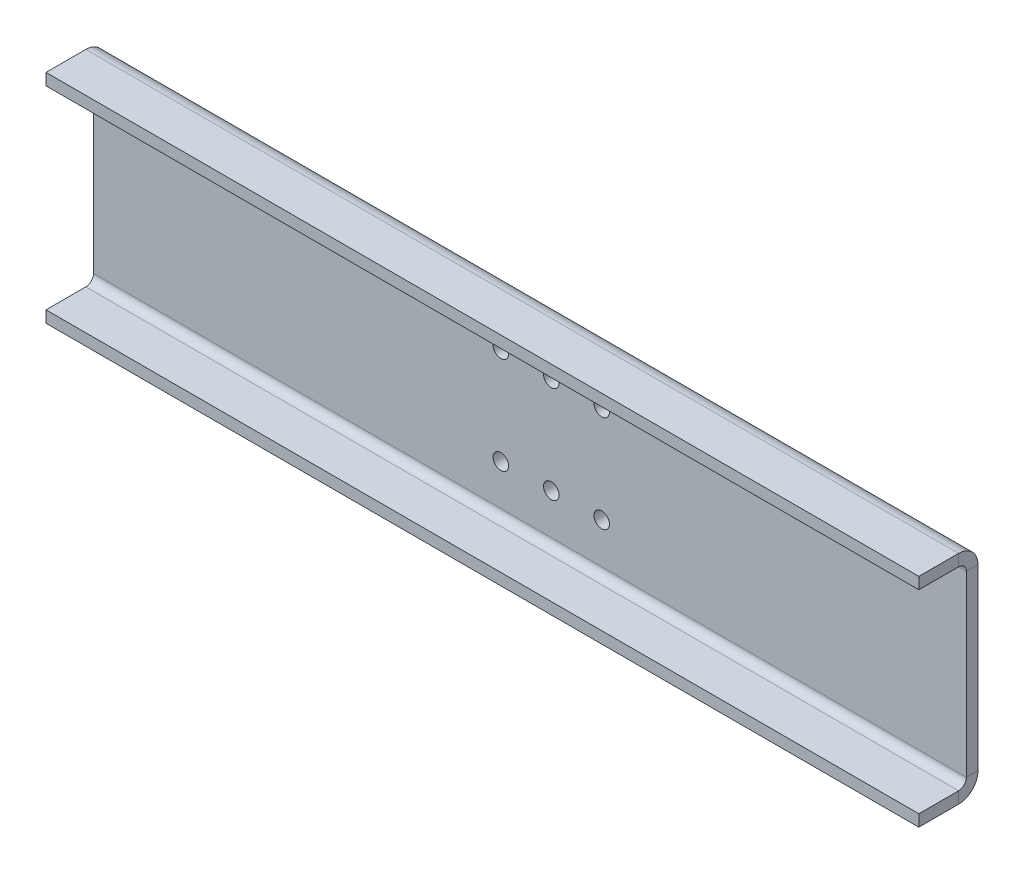
ISO-10303-21;
HEADER;
FILE_DESCRIPTION(('STEP AP214'),'2;1');
FILE_NAME('part.step','',(''),(''),'','','');
FILE_SCHEMA(('AUTOMOTIVE_DESIGN { 1 0 10303 214 1 1 1 1 }'));
ENDSEC;
DATA;
#1=APPLICATION_CONTEXT('core data for automotive mechanical design processes');
#2=APPLICATION_PROTOCOL_DEFINITION('international standard','automotive_design',2000,#1);
#3=PRODUCT_CONTEXT('',#1,'mechanical');
#4=PRODUCT('Part','Part','',(#3));
#5=PRODUCT_RELATED_PRODUCT_CATEGORY('part','',(#4));
#6=PRODUCT_DEFINITION_FORMATION('','',#4);
#7=PRODUCT_DEFINITION_CONTEXT('part definition',#1,'design');
#8=PRODUCT_DEFINITION('design','',#6,#7);
#9=PRODUCT_DEFINITION_SHAPE('','',#8);
#10=(LENGTH_UNIT() NAMED_UNIT(*) SI_UNIT(.MILLI.,.METRE.));
#11=(NAMED_UNIT(*) PLANE_ANGLE_UNIT() SI_UNIT($,.RADIAN.));
#12=(NAMED_UNIT(*) SI_UNIT($,.STERADIAN.) SOLID_ANGLE_UNIT());
#13=UNCERTAINTY_MEASURE_WITH_UNIT(LENGTH_MEASURE(1.E-05),#10,'distance_accuracy_value','');
#14=(GEOMETRIC_REPRESENTATION_CONTEXT(3) GLOBAL_UNCERTAINTY_ASSIGNED_CONTEXT((#13)) GLOBAL_UNIT_ASSIGNED_CONTEXT((#10,
#11,#12)) REPRESENTATION_CONTEXT('',''));
#15=CARTESIAN_POINT('',(0.,0.,0.));
#16=DIRECTION('',(0.,0.,1.));
#17=DIRECTION('',(1.,0.,0.));
#18=AXIS2_PLACEMENT_3D('',#15,#16,#17);
#19=CARTESIAN_POINT('',(0.,39.1323199636982,34.6301071074805));
#20=DIRECTION('',(0.,0.,1.));
#21=DIRECTION('',(0.,-1.,0.));
#22=AXIS2_PLACEMENT_3D('',#19,#20,#21);
#23=PLANE('',#22);
#24=CARTESIAN_POINT('',(64.5,40.5011064281089,34.6301071074805));
#25=DIRECTION('',(0.,0.,1.));
#26=DIRECTION('',(0.,-1.,0.));
#27=AXIS2_PLACEMENT_3D('',#24,#25,#26);
#28=CIRCLE('',#27,2.);
#29=CARTESIAN_POINT('',(64.5,38.501106428109,34.6301071074805));
#30=VERTEX_POINT('',#29);
#31=EDGE_CURVE('E227',#30,#30,#28,.T.);
#32=ORIENTED_EDGE('',*,*,#31,.T.);
#33=EDGE_LOOP('',(#32));
#34=FACE_BOUND('',#33,.T.);
#35=CARTESIAN_POINT('',(51.5,40.5011064281089,34.6301071074805));
#36=DIRECTION('',(0.,0.,1.));
#37=DIRECTION('',(0.,-1.,0.));
#38=AXIS2_PLACEMENT_3D('',#35,#36,#37);
#39=CIRCLE('',#38,2.);
#40=CARTESIAN_POINT('',(51.5,38.501106428109,34.6301071074805));
#41=VERTEX_POINT('',#40);
#42=EDGE_CURVE('E254',#41,#41,#39,.T.);
#43=ORIENTED_EDGE('',*,*,#42,.T.);
#44=EDGE_LOOP('',(#43));
#45=FACE_BOUND('',#44,.T.);
#46=CARTESIAN_POINT('',(38.5,40.5011064281089,34.6301071074805));
#47=DIRECTION('',(0.,0.,1.));
#48=DIRECTION('',(0.,-1.,0.));
#49=AXIS2_PLACEMENT_3D('',#46,#47,#48);
#50=CIRCLE('',#49,2.);
#51=CARTESIAN_POINT('',(38.5,38.501106428109,34.6301071074805));
#52=VERTEX_POINT('',#51);
#53=EDGE_CURVE('E257',#52,#52,#50,.T.);
#54=ORIENTED_EDGE('',*,*,#53,.T.);
#55=EDGE_LOOP('',(#54));
#56=FACE_BOUND('',#55,.T.);
#57=CARTESIAN_POINT('',(38.5,15.5011064281089,34.6301071074804));
#58=DIRECTION('',(0.,0.,1.));
#59=DIRECTION('',(0.,-1.,0.));
#60=AXIS2_PLACEMENT_3D('',#57,#58,#59);
#61=CIRCLE('',#60,2.);
#62=CARTESIAN_POINT('',(38.5,13.5011064281089,34.6301071074804));
#63=VERTEX_POINT('',#62);
#64=EDGE_CURVE('E260',#63,#63,#61,.T.);
#65=ORIENTED_EDGE('',*,*,#64,.T.);
#66=EDGE_LOOP('',(#65));
#67=FACE_BOUND('',#66,.T.);
#68=CARTESIAN_POINT('',(51.5,15.5011064281089,34.6301071074804));
#69=DIRECTION('',(0.,0.,1.));
#70=DIRECTION('',(0.,-1.,0.));
#71=AXIS2_PLACEMENT_3D('',#68,#69,#70);
#72=CIRCLE('',#71,2.);
#73=CARTESIAN_POINT('',(51.5,13.5011064281089,34.6301071074804));
#74=VERTEX_POINT('',#73);
#75=EDGE_CURVE('E263',#74,#74,#72,.T.);
#76=ORIENTED_EDGE('',*,*,#75,.T.);
#77=EDGE_LOOP('',(#76));
#78=FACE_BOUND('',#77,.T.);
#79=CARTESIAN_POINT('',(64.5,15.5011064281089,34.6301071074804));
#80=DIRECTION('',(0.,0.,1.));
#81=DIRECTION('',(0.,-1.,0.));
#82=AXIS2_PLACEMENT_3D('',#79,#80,#81);
#83=CIRCLE('',#82,2.);
#84=CARTESIAN_POINT('',(64.5,13.5011064281089,34.6301071074804));
#85=VERTEX_POINT('',#84);
#86=EDGE_CURVE('E235',#85,#85,#83,.T.);
#87=ORIENTED_EDGE('',*,*,#86,.T.);
#88=EDGE_LOOP('',(#87));
#89=FACE_BOUND('',#88,.T.);
#90=DIRECTION('',(0.,-1.,0.));
#91=VECTOR('',#90,1.);
#92=CARTESIAN_POINT('',(158.5,39.1323199636982,34.6301071074805));
#93=LINE('',#92,#91);
#94=CARTESIAN_POINT('',(158.5,5.00000000000002,34.6301071074803));
#95=VERTEX_POINT('',#94);
#96=CARTESIAN_POINT('',(158.5,51.002212856218,34.6301071074805));
#97=VERTEX_POINT('',#96);
#98=EDGE_CURVE('E62',#95,#97,#93,.F.);
#99=ORIENTED_EDGE('',*,*,#98,.F.);
#100=DIRECTION('',(-1.,0.,0.));
#101=VECTOR('',#100,1.);
#102=CARTESIAN_POINT('',(0.,5.00000000000002,34.6301071074803));
#103=LINE('',#102,#101);
#104=CARTESIAN_POINT('',(-66.5,5.00000000000002,34.6301071074803));
#105=VERTEX_POINT('',#104);
#106=EDGE_CURVE('E54',#95,#105,#103,.T.);
#107=ORIENTED_EDGE('',*,*,#106,.T.);
#108=DIRECTION('',(0.,-1.,0.));
#109=VECTOR('',#108,1.);
#110=CARTESIAN_POINT('',(-66.5,39.1323199636982,34.6301071074805));
#111=LINE('',#110,#109);
#112=CARTESIAN_POINT('',(-66.5,51.002212856218,34.6301071074805));
#113=VERTEX_POINT('',#112);
#114=EDGE_CURVE('E70',#113,#105,#111,.T.);
#115=ORIENTED_EDGE('',*,*,#114,.F.);
#116=DIRECTION('',(-1.,0.,0.));
#117=VECTOR('',#116,1.);
#118=CARTESIAN_POINT('',(0.,51.002212856218,34.6301071074805));
#119=LINE('',#118,#117);
#120=EDGE_CURVE('E273',#97,#113,#119,.T.);
#121=ORIENTED_EDGE('',*,*,#120,.F.);
#122=EDGE_LOOP('',(#99,#107,#115,#121));
#123=FACE_BOUND('',#122,.T.);
#124=ADVANCED_FACE('F45',(#34,#45,#56,#67,#78,#89,#123),#23,.F.);
#125=CARTESIAN_POINT('',(158.5,66.751106428109,37.6301071074805));
#126=DIRECTION('',(1.,0.,0.));
#127=DIRECTION('',(0.,1.,0.));
#128=AXIS2_PLACEMENT_3D('',#125,#126,#127);
#129=PLANE('',#128);
#130=DIRECTION('',(0.,0.,1.));
#131=VECTOR('',#130,1.);
#132=CARTESIAN_POINT('',(158.5,5.,37.6301071074803));
#133=LINE('',#132,#131);
#134=CARTESIAN_POINT('',(158.5,5.,37.6301071074803));
#135=VERTEX_POINT('',#134);
#136=EDGE_CURVE('E12',#95,#135,#133,.T.);
#137=ORIENTED_EDGE('',*,*,#136,.F.);
#138=ORIENTED_EDGE('',*,*,#98,.T.);
#139=DIRECTION('',(0.,0.,1.));
#140=VECTOR('',#139,1.);
#141=CARTESIAN_POINT('',(158.5,51.002212856218,37.6301071074805));
#142=LINE('',#141,#140);
#143=CARTESIAN_POINT('',(158.5,51.002212856218,37.6301071074805));
#144=VERTEX_POINT('',#143);
#145=EDGE_CURVE('E270',#97,#144,#142,.T.);
#146=ORIENTED_EDGE('',*,*,#145,.T.);
#147=DIRECTION('',(0.,1.,0.));
#148=VECTOR('',#147,1.);
#149=CARTESIAN_POINT('',(158.5,66.751106428109,37.6301071074805));
#150=LINE('',#149,#148);
#151=EDGE_CURVE('E49',#135,#144,#150,.T.);
#152=ORIENTED_EDGE('',*,*,#151,.F.);
#153=EDGE_LOOP('',(#137,#138,#146,#152));
#154=FACE_BOUND('',#153,.T.);
#155=ADVANCED_FACE('F47',(#154),#129,.T.);
#156=CARTESIAN_POINT('',(-66.5,66.7511064281089,37.6301071074805));
#157=DIRECTION('',(-1.,0.,0.));
#158=DIRECTION('',(0.,-1.,0.));
#159=AXIS2_PLACEMENT_3D('',#156,#157,#158);
#160=PLANE('',#159);
#161=DIRECTION('',(0.,0.,-1.));
#162=VECTOR('',#161,1.);
#163=CARTESIAN_POINT('',(-66.5,5.,37.6301071074803));
#164=LINE('',#163,#162);
#165=CARTESIAN_POINT('',(-66.5,5.00000000000001,37.6301071074803));
#166=VERTEX_POINT('',#165);
#167=EDGE_CURVE('E279',#166,#105,#164,.T.);
#168=ORIENTED_EDGE('',*,*,#167,.F.);
#169=DIRECTION('',(0.,-1.,0.));
#170=VECTOR('',#169,1.);
#171=CARTESIAN_POINT('',(-66.5,66.7511064281089,37.6301071074805));
#172=LINE('',#171,#170);
#173=CARTESIAN_POINT('',(-66.5,51.002212856218,37.6301071074805));
#174=VERTEX_POINT('',#173);
#175=EDGE_CURVE('E241',#174,#166,#172,.T.);
#176=ORIENTED_EDGE('',*,*,#175,.F.);
#177=DIRECTION('',(0.,0.,-1.));
#178=VECTOR('',#177,1.);
#179=CARTESIAN_POINT('',(-66.5,51.002212856218,37.6301071074805));
#180=LINE('',#179,#178);
#181=EDGE_CURVE('E276',#174,#113,#180,.T.);
#182=ORIENTED_EDGE('',*,*,#181,.T.);
#183=ORIENTED_EDGE('',*,*,#114,.T.);
#184=EDGE_LOOP('',(#168,#176,#182,#183));
#185=FACE_BOUND('',#184,.T.);
#186=ADVANCED_FACE('F331',(#185),#160,.T.);
#187=CARTESIAN_POINT('',(0.,39.1323199636982,37.6301071074805));
#188=DIRECTION('',(0.,0.,1.));
#189=DIRECTION('',(0.,-1.,0.));
#190=AXIS2_PLACEMENT_3D('',#187,#188,#189);
#191=PLANE('',#190);
#192=DIRECTION('',(-1.,0.,0.));
#193=VECTOR('',#192,1.);
#194=CARTESIAN_POINT('',(0.,5.,37.6301071074803));
#195=LINE('',#194,#193);
#196=EDGE_CURVE('E158',#135,#166,#195,.T.);
#197=ORIENTED_EDGE('',*,*,#196,.F.);
#198=ORIENTED_EDGE('',*,*,#151,.T.);
#199=DIRECTION('',(-1.,0.,0.));
#200=VECTOR('',#199,1.);
#201=CARTESIAN_POINT('',(0.,51.002212856218,37.6301071074805));
#202=LINE('',#201,#200);
#203=EDGE_CURVE('E251',#144,#174,#202,.T.);
#204=ORIENTED_EDGE('',*,*,#203,.T.);
#205=ORIENTED_EDGE('',*,*,#175,.T.);
#206=EDGE_LOOP('',(#197,#198,#204,#205));
#207=FACE_BOUND('',#206,.T.);
#208=CARTESIAN_POINT('',(64.5,40.5011064281089,37.6301071074805));
#209=DIRECTION('',(0.,0.,1.));
#210=DIRECTION('',(0.,-1.,0.));
#211=AXIS2_PLACEMENT_3D('',#208,#209,#210);
#212=CIRCLE('',#211,2.);
#213=CARTESIAN_POINT('',(64.5,38.5011064281089,37.6301071074804));
#214=VERTEX_POINT('',#213);
#215=EDGE_CURVE('E231',#214,#214,#212,.T.);
#216=ORIENTED_EDGE('',*,*,#215,.F.);
#217=EDGE_LOOP('',(#216));
#218=FACE_BOUND('',#217,.T.);
#219=CARTESIAN_POINT('',(51.5,40.5011064281089,37.6301071074805));
#220=DIRECTION('',(0.,0.,1.));
#221=DIRECTION('',(0.,-1.,0.));
#222=AXIS2_PLACEMENT_3D('',#219,#220,#221);
#223=CIRCLE('',#222,2.);
#224=CARTESIAN_POINT('',(51.5,38.5011064281089,37.6301071074804));
#225=VERTEX_POINT('',#224);
#226=EDGE_CURVE('E234',#225,#225,#223,.T.);
#227=ORIENTED_EDGE('',*,*,#226,.F.);
#228=EDGE_LOOP('',(#227));
#229=FACE_BOUND('',#228,.T.);
#230=CARTESIAN_POINT('',(38.5,40.5011064281089,37.6301071074805));
#231=DIRECTION('',(0.,0.,1.));
#232=DIRECTION('',(0.,-1.,0.));
#233=AXIS2_PLACEMENT_3D('',#230,#231,#232);
#234=CIRCLE('',#233,2.);
#235=CARTESIAN_POINT('',(38.5,38.5011064281089,37.6301071074804));
#236=VERTEX_POINT('',#235);
#237=EDGE_CURVE('E238',#236,#236,#234,.T.);
#238=ORIENTED_EDGE('',*,*,#237,.F.);
#239=EDGE_LOOP('',(#238));
#240=FACE_BOUND('',#239,.T.);
#241=CARTESIAN_POINT('',(38.5,15.5011064281089,37.6301071074804));
#242=DIRECTION('',(0.,0.,1.));
#243=DIRECTION('',(0.,1.,0.));
#244=AXIS2_PLACEMENT_3D('',#241,#242,#243);
#245=CIRCLE('',#244,2.);
#246=CARTESIAN_POINT('',(38.5,17.5011064281089,37.6301071074804));
#247=VERTEX_POINT('',#246);
#248=EDGE_CURVE('E242',#247,#247,#245,.T.);
#249=ORIENTED_EDGE('',*,*,#248,.F.);
#250=EDGE_LOOP('',(#249));
#251=FACE_BOUND('',#250,.T.);
#252=CARTESIAN_POINT('',(51.5,15.5011064281089,37.6301071074804));
#253=DIRECTION('',(0.,0.,1.));
#254=DIRECTION('',(0.,1.,0.));
#255=AXIS2_PLACEMENT_3D('',#252,#253,#254);
#256=CIRCLE('',#255,2.);
#257=CARTESIAN_POINT('',(51.5,17.5011064281089,37.6301071074804));
#258=VERTEX_POINT('',#257);
#259=EDGE_CURVE('E245',#258,#258,#256,.T.);
#260=ORIENTED_EDGE('',*,*,#259,.F.);
#261=EDGE_LOOP('',(#260));
#262=FACE_BOUND('',#261,.T.);
#263=CARTESIAN_POINT('',(64.5,15.5011064281089,37.6301071074804));
#264=DIRECTION('',(0.,0.,1.));
#265=DIRECTION('',(0.,1.,0.));
#266=AXIS2_PLACEMENT_3D('',#263,#264,#265);
#267=CIRCLE('',#266,2.);
#268=CARTESIAN_POINT('',(64.5,17.5011064281089,37.6301071074804));
#269=VERTEX_POINT('',#268);
#270=EDGE_CURVE('E248',#269,#269,#267,.T.);
#271=ORIENTED_EDGE('',*,*,#270,.F.);
#272=EDGE_LOOP('',(#271));
#273=FACE_BOUND('',#272,.T.);
#274=ADVANCED_FACE('F288',(#207,#218,#229,#240,#251,#262,#273),#191,.T.);
#275=CARTESIAN_POINT('',(64.5,40.5011064281089,37.6301071074805));
#276=DIRECTION('',(0.,0.,1.));
#277=DIRECTION('',(0.,-1.,0.));
#278=AXIS2_PLACEMENT_3D('',#275,#276,#277);
#279=CYLINDRICAL_SURFACE('',#278,2.);
#280=ORIENTED_EDGE('',*,*,#215,.T.);
#281=EDGE_LOOP('',(#280));
#282=FACE_BOUND('',#281,.T.);
#283=ORIENTED_EDGE('',*,*,#31,.F.);
#284=EDGE_LOOP('',(#283));
#285=FACE_BOUND('',#284,.T.);
#286=ADVANCED_FACE('F338',(#282,#285),#279,.F.);
#287=CARTESIAN_POINT('',(51.5,40.5011064281089,37.6301071074805));
#288=DIRECTION('',(0.,0.,1.));
#289=DIRECTION('',(0.,-1.,0.));
#290=AXIS2_PLACEMENT_3D('',#287,#288,#289);
#291=CYLINDRICAL_SURFACE('',#290,2.);
#292=ORIENTED_EDGE('',*,*,#226,.T.);
#293=EDGE_LOOP('',(#292));
#294=FACE_BOUND('',#293,.T.);
#295=ORIENTED_EDGE('',*,*,#42,.F.);
#296=EDGE_LOOP('',(#295));
#297=FACE_BOUND('',#296,.T.);
#298=ADVANCED_FACE('F354',(#294,#297),#291,.F.);
#299=CARTESIAN_POINT('',(38.5,40.5011064281089,37.6301071074805));
#300=DIRECTION('',(0.,0.,1.));
#301=DIRECTION('',(0.,-1.,0.));
#302=AXIS2_PLACEMENT_3D('',#299,#300,#301);
#303=CYLINDRICAL_SURFACE('',#302,2.);
#304=ORIENTED_EDGE('',*,*,#237,.T.);
#305=EDGE_LOOP('',(#304));
#306=FACE_BOUND('',#305,.T.);
#307=ORIENTED_EDGE('',*,*,#53,.F.);
#308=EDGE_LOOP('',(#307));
#309=FACE_BOUND('',#308,.T.);
#310=ADVANCED_FACE('F350',(#306,#309),#303,.F.);
#311=CARTESIAN_POINT('',(38.5,15.5011064281089,37.6301071074804));
#312=DIRECTION('',(0.,0.,1.));
#313=DIRECTION('',(0.,-1.,0.));
#314=AXIS2_PLACEMENT_3D('',#311,#312,#313);
#315=CYLINDRICAL_SURFACE('',#314,2.);
#316=ORIENTED_EDGE('',*,*,#248,.T.);
#317=EDGE_LOOP('',(#316));
#318=FACE_BOUND('',#317,.T.);
#319=ORIENTED_EDGE('',*,*,#64,.F.);
#320=EDGE_LOOP('',(#319));
#321=FACE_BOUND('',#320,.T.);
#322=ADVANCED_FACE('F346',(#318,#321),#315,.F.);
#323=CARTESIAN_POINT('',(51.5,15.5011064281089,37.6301071074804));
#324=DIRECTION('',(0.,0.,1.));
#325=DIRECTION('',(0.,-1.,0.));
#326=AXIS2_PLACEMENT_3D('',#323,#324,#325);
#327=CYLINDRICAL_SURFACE('',#326,2.);
#328=ORIENTED_EDGE('',*,*,#259,.T.);
#329=EDGE_LOOP('',(#328));
#330=FACE_BOUND('',#329,.T.);
#331=ORIENTED_EDGE('',*,*,#75,.F.);
#332=EDGE_LOOP('',(#331));
#333=FACE_BOUND('',#332,.T.);
#334=ADVANCED_FACE('F342',(#330,#333),#327,.F.);
#335=CARTESIAN_POINT('',(64.5,15.5011064281089,37.6301071074804));
#336=DIRECTION('',(0.,0.,1.));
#337=DIRECTION('',(0.,-1.,0.));
#338=AXIS2_PLACEMENT_3D('',#335,#336,#337);
#339=CYLINDRICAL_SURFACE('',#338,2.);
#340=ORIENTED_EDGE('',*,*,#270,.T.);
#341=EDGE_LOOP('',(#340));
#342=FACE_BOUND('',#341,.T.);
#343=ORIENTED_EDGE('',*,*,#86,.F.);
#344=EDGE_LOOP('',(#343));
#345=FACE_BOUND('',#344,.T.);
#346=ADVANCED_FACE('F339',(#342,#345),#339,.F.);
#347=CARTESIAN_POINT('',(158.5,51.002212856218,39.6301071074805));
#348=DIRECTION('',(-1.,0.,0.));
#349=DIRECTION('',(0.,-1.,0.));
#350=AXIS2_PLACEMENT_3D('',#347,#348,#349);
#351=PLANE('',#350);
#352=ORIENTED_EDGE('',*,*,#145,.F.);
#353=CARTESIAN_POINT('',(158.5,51.002212856218,39.6301071074805));
#354=DIRECTION('',(-1.,0.,0.));
#355=DIRECTION('',(0.,-1.,0.));
#356=AXIS2_PLACEMENT_3D('',#353,#354,#355);
#357=CIRCLE('',#356,5.);
#358=CARTESIAN_POINT('',(158.5,56.002212856218,39.6301071074805));
#359=VERTEX_POINT('',#358);
#360=EDGE_CURVE('E188',#97,#359,#357,.F.);
#361=ORIENTED_EDGE('',*,*,#360,.T.);
#362=DIRECTION('',(0.,-1.,0.));
#363=VECTOR('',#362,1.);
#364=CARTESIAN_POINT('',(158.5,53.002212856218,39.6301071074805));
#365=LINE('',#364,#363);
#366=CARTESIAN_POINT('',(158.5,53.002212856218,39.6301071074805));
#367=VERTEX_POINT('',#366);
#368=EDGE_CURVE('E210',#359,#367,#365,.T.);
#369=ORIENTED_EDGE('',*,*,#368,.T.);
#370=CARTESIAN_POINT('',(158.5,51.002212856218,39.6301071074805));
#371=DIRECTION('',(1.,0.,0.));
#372=DIRECTION('',(0.,1.,0.));
#373=AXIS2_PLACEMENT_3D('',#370,#371,#372);
#374=CIRCLE('',#373,2.);
#375=EDGE_CURVE('E220',#144,#367,#374,.T.);
#376=ORIENTED_EDGE('',*,*,#375,.F.);
#377=EDGE_LOOP('',(#352,#361,#369,#376));
#378=FACE_BOUND('',#377,.T.);
#379=ADVANCED_FACE('F294',(#378),#351,.F.);
#380=CARTESIAN_POINT('',(-66.5,51.002212856218,39.6301071074805));
#381=DIRECTION('',(1.,0.,0.));
#382=DIRECTION('',(0.,1.,0.));
#383=AXIS2_PLACEMENT_3D('',#380,#381,#382);
#384=PLANE('',#383);
#385=CARTESIAN_POINT('',(-66.5,51.002212856218,39.6301071074805));
#386=DIRECTION('',(-1.,0.,0.));
#387=DIRECTION('',(0.,-1.,0.));
#388=AXIS2_PLACEMENT_3D('',#385,#386,#387);
#389=CIRCLE('',#388,5.);
#390=CARTESIAN_POINT('',(-66.5,56.002212856218,39.6301071074805));
#391=VERTEX_POINT('',#390);
#392=EDGE_CURVE('E224',#391,#113,#389,.T.);
#393=ORIENTED_EDGE('',*,*,#392,.T.);
#394=ORIENTED_EDGE('',*,*,#181,.F.);
#395=CARTESIAN_POINT('',(-66.5,51.002212856218,39.6301071074805));
#396=DIRECTION('',(-1.,0.,0.));
#397=DIRECTION('',(0.,-1.,0.));
#398=AXIS2_PLACEMENT_3D('',#395,#396,#397);
#399=CIRCLE('',#398,2.);
#400=CARTESIAN_POINT('',(-66.5,53.002212856218,39.6301071074805));
#401=VERTEX_POINT('',#400);
#402=EDGE_CURVE('E223',#401,#174,#399,.T.);
#403=ORIENTED_EDGE('',*,*,#402,.F.);
#404=DIRECTION('',(0.,1.,0.));
#405=VECTOR('',#404,1.);
#406=CARTESIAN_POINT('',(-66.5,53.002212856218,39.6301071074805));
#407=LINE('',#406,#405);
#408=EDGE_CURVE('E213',#401,#391,#407,.T.);
#409=ORIENTED_EDGE('',*,*,#408,.T.);
#410=EDGE_LOOP('',(#393,#394,#403,#409));
#411=FACE_BOUND('',#410,.T.);
#412=ADVANCED_FACE('F306',(#411),#384,.F.);
#413=CARTESIAN_POINT('',(271.087151262524,51.002212856218,39.6301071074805));
#414=DIRECTION('',(-1.,0.,0.));
#415=DIRECTION('',(0.,-1.,0.));
#416=AXIS2_PLACEMENT_3D('',#413,#414,#415);
#417=CYLINDRICAL_SURFACE('',#416,2.);
#418=DIRECTION('',(-1.,0.,0.));
#419=VECTOR('',#418,1.);
#420=CARTESIAN_POINT('',(0.,53.002212856218,39.6301071074805));
#421=LINE('',#420,#419);
#422=EDGE_CURVE('E216',#367,#401,#421,.T.);
#423=ORIENTED_EDGE('',*,*,#422,.T.);
#424=ORIENTED_EDGE('',*,*,#402,.T.);
#425=ORIENTED_EDGE('',*,*,#203,.F.);
#426=ORIENTED_EDGE('',*,*,#375,.T.);
#427=EDGE_LOOP('',(#423,#424,#425,#426));
#428=FACE_BOUND('',#427,.T.);
#429=ADVANCED_FACE('F315',(#428),#417,.F.);
#430=CARTESIAN_POINT('',(271.087151262524,51.002212856218,39.6301071074805));
#431=DIRECTION('',(-1.,0.,0.));
#432=DIRECTION('',(0.,-1.,0.));
#433=AXIS2_PLACEMENT_3D('',#430,#431,#432);
#434=CYLINDRICAL_SURFACE('',#433,5.);
#435=DIRECTION('',(-1.,0.,0.));
#436=VECTOR('',#435,1.);
#437=CARTESIAN_POINT('',(0.,56.002212856218,39.6301071074805));
#438=LINE('',#437,#436);
#439=EDGE_CURVE('E189',#359,#391,#438,.T.);
#440=ORIENTED_EDGE('',*,*,#439,.F.);
#441=ORIENTED_EDGE('',*,*,#360,.F.);
#442=ORIENTED_EDGE('',*,*,#120,.T.);
#443=ORIENTED_EDGE('',*,*,#392,.F.);
#444=EDGE_LOOP('',(#440,#441,#442,#443));
#445=FACE_BOUND('',#444,.T.);
#446=ADVANCED_FACE('F297',(#445),#434,.T.);
#447=CARTESIAN_POINT('',(-66.5,53.0022128562179,49.8812135355893));
#448=DIRECTION('',(0.,0.,1.));
#449=DIRECTION('',(-1.,0.,0.));
#450=AXIS2_PLACEMENT_3D('',#447,#448,#449);
#451=PLANE('',#450);
#452=DIRECTION('',(0.,-1.,0.));
#453=VECTOR('',#452,1.);
#454=CARTESIAN_POINT('',(158.5,53.0022128562179,49.8812135355894));
#455=LINE('',#454,#453);
#456=CARTESIAN_POINT('',(158.5,56.0022128562179,49.8812135355895));
#457=VERTEX_POINT('',#456);
#458=CARTESIAN_POINT('',(158.5,53.0022128562179,49.8812135355894));
#459=VERTEX_POINT('',#458);
#460=EDGE_CURVE('E192',#457,#459,#455,.T.);
#461=ORIENTED_EDGE('',*,*,#460,.F.);
#462=DIRECTION('',(1.,0.,0.));
#463=VECTOR('',#462,1.);
#464=CARTESIAN_POINT('',(0.,56.0022128562179,49.8812135355895));
#465=LINE('',#464,#463);
#466=CARTESIAN_POINT('',(-66.5,56.0022128562179,49.8812135355893));
#467=VERTEX_POINT('',#466);
#468=EDGE_CURVE('E207',#457,#467,#465,.F.);
#469=ORIENTED_EDGE('',*,*,#468,.T.);
#470=DIRECTION('',(0.,-1.,0.));
#471=VECTOR('',#470,1.);
#472=CARTESIAN_POINT('',(-66.5,53.0022128562179,49.8812135355893));
#473=LINE('',#472,#471);
#474=CARTESIAN_POINT('',(-66.5,53.0022128562179,49.8812135355893));
#475=VERTEX_POINT('',#474);
#476=EDGE_CURVE('E205',#467,#475,#473,.T.);
#477=ORIENTED_EDGE('',*,*,#476,.T.);
#478=DIRECTION('',(-1.,0.,0.));
#479=VECTOR('',#478,1.);
#480=CARTESIAN_POINT('',(-66.5,53.0022128562179,49.8812135355893));
#481=LINE('',#480,#479);
#482=EDGE_CURVE('E200',#459,#475,#481,.T.);
#483=ORIENTED_EDGE('',*,*,#482,.F.);
#484=EDGE_LOOP('',(#461,#469,#477,#483));
#485=FACE_BOUND('',#484,.T.);
#486=ADVANCED_FACE('F322',(#485),#451,.T.);
#487=CARTESIAN_POINT('',(0.,53.0022128562181,22.2624270711786));
#488=DIRECTION('',(0.,-1.,0.));
#489=DIRECTION('',(0.,0.,-1.));
#490=AXIS2_PLACEMENT_3D('',#487,#488,#489);
#491=PLANE('',#490);
#492=ORIENTED_EDGE('',*,*,#422,.F.);
#493=DIRECTION('',(0.,0.,1.));
#494=VECTOR('',#493,1.);
#495=CARTESIAN_POINT('',(158.5,53.0022128562179,49.8812135355894));
#496=LINE('',#495,#494);
#497=EDGE_CURVE('E203',#367,#459,#496,.T.);
#498=ORIENTED_EDGE('',*,*,#497,.T.);
#499=ORIENTED_EDGE('',*,*,#482,.T.);
#500=DIRECTION('',(0.,0.,-1.));
#501=VECTOR('',#500,1.);
#502=CARTESIAN_POINT('',(-66.5,53.0022128562179,49.8812135355893));
#503=LINE('',#502,#501);
#504=EDGE_CURVE('E197',#475,#401,#503,.T.);
#505=ORIENTED_EDGE('',*,*,#504,.T.);
#506=EDGE_LOOP('',(#492,#498,#499,#505));
#507=FACE_BOUND('',#506,.T.);
#508=ADVANCED_FACE('F311',(#507),#491,.T.);
#509=CARTESIAN_POINT('',(158.5,53.0022128562179,49.8812135355894));
#510=DIRECTION('',(1.,0.,0.));
#511=DIRECTION('',(0.,0.,1.));
#512=AXIS2_PLACEMENT_3D('',#509,#510,#511);
#513=PLANE('',#512);
#514=ORIENTED_EDGE('',*,*,#368,.F.);
#515=DIRECTION('',(0.,0.,-1.));
#516=VECTOR('',#515,1.);
#517=CARTESIAN_POINT('',(158.5,56.0022128562181,22.2624270711786));
#518=LINE('',#517,#516);
#519=EDGE_CURVE('E195',#359,#457,#518,.F.);
#520=ORIENTED_EDGE('',*,*,#519,.T.);
#521=ORIENTED_EDGE('',*,*,#460,.T.);
#522=ORIENTED_EDGE('',*,*,#497,.F.);
#523=EDGE_LOOP('',(#514,#520,#521,#522));
#524=FACE_BOUND('',#523,.T.);
#525=ADVANCED_FACE('F405',(#524),#513,.T.);
#526=CARTESIAN_POINT('',(0.,56.0022128562181,22.2624270711786));
#527=DIRECTION('',(0.,-1.,0.));
#528=DIRECTION('',(0.,0.,-1.));
#529=AXIS2_PLACEMENT_3D('',#526,#527,#528);
#530=PLANE('',#529);
#531=ORIENTED_EDGE('',*,*,#519,.F.);
#532=ORIENTED_EDGE('',*,*,#439,.T.);
#533=DIRECTION('',(0.,0.,-1.));
#534=VECTOR('',#533,1.);
#535=CARTESIAN_POINT('',(-66.5,56.0022128562181,22.2624270711786));
#536=LINE('',#535,#534);
#537=EDGE_CURVE('E186',#467,#391,#536,.T.);
#538=ORIENTED_EDGE('',*,*,#537,.F.);
#539=ORIENTED_EDGE('',*,*,#468,.F.);
#540=EDGE_LOOP('',(#531,#532,#538,#539));
#541=FACE_BOUND('',#540,.T.);
#542=ADVANCED_FACE('F301',(#541),#530,.F.);
#543=CARTESIAN_POINT('',(-66.5,53.0022128562179,49.8812135355893));
#544=DIRECTION('',(-1.,0.,0.));
#545=DIRECTION('',(0.,0.,-1.));
#546=AXIS2_PLACEMENT_3D('',#543,#544,#545);
#547=PLANE('',#546);
#548=ORIENTED_EDGE('',*,*,#408,.F.);
#549=ORIENTED_EDGE('',*,*,#504,.F.);
#550=ORIENTED_EDGE('',*,*,#476,.F.);
#551=ORIENTED_EDGE('',*,*,#537,.T.);
#552=EDGE_LOOP('',(#548,#549,#550,#551));
#553=FACE_BOUND('',#552,.T.);
#554=ADVANCED_FACE('F309',(#553),#547,.T.);
#555=CARTESIAN_POINT('',(-66.5,3.,49.8812135355893));
#556=DIRECTION('',(0.,0.,1.));
#557=DIRECTION('',(1.,0.,0.));
#558=AXIS2_PLACEMENT_3D('',#555,#556,#557);
#559=PLANE('',#558);
#560=DIRECTION('',(1.,0.,0.));
#561=VECTOR('',#560,1.);
#562=CARTESIAN_POINT('',(0.,0.,49.8812135355893));
#563=LINE('',#562,#561);
#564=CARTESIAN_POINT('',(-66.5,0.,49.8812135355893));
#565=VERTEX_POINT('',#564);
#566=CARTESIAN_POINT('',(158.5,0.,49.8812135355893));
#567=VERTEX_POINT('',#566);
#568=EDGE_CURVE('E182',#565,#567,#563,.T.);
#569=ORIENTED_EDGE('',*,*,#568,.T.);
#570=DIRECTION('',(0.,1.,0.));
#571=VECTOR('',#570,1.);
#572=CARTESIAN_POINT('',(158.5,3.,49.8812135355893));
#573=LINE('',#572,#571);
#574=CARTESIAN_POINT('',(158.5,3.,49.8812135355893));
#575=VERTEX_POINT('',#574);
#576=EDGE_CURVE('E180',#567,#575,#573,.T.);
#577=ORIENTED_EDGE('',*,*,#576,.T.);
#578=DIRECTION('',(1.,0.,0.));
#579=VECTOR('',#578,1.);
#580=CARTESIAN_POINT('',(-66.5,3.,49.8812135355893));
#581=LINE('',#580,#579);
#582=CARTESIAN_POINT('',(-66.5,3.,49.8812135355893));
#583=VERTEX_POINT('',#582);
#584=EDGE_CURVE('E149',#583,#575,#581,.T.);
#585=ORIENTED_EDGE('',*,*,#584,.F.);
#586=DIRECTION('',(0.,1.,0.));
#587=VECTOR('',#586,1.);
#588=CARTESIAN_POINT('',(-66.5,3.,49.8812135355893));
#589=LINE('',#588,#587);
#590=EDGE_CURVE('E174',#565,#583,#589,.T.);
#591=ORIENTED_EDGE('',*,*,#590,.F.);
#592=EDGE_LOOP('',(#569,#577,#585,#591));
#593=FACE_BOUND('',#592,.T.);
#594=ADVANCED_FACE('F435',(#593),#559,.T.);
#595=CARTESIAN_POINT('',(0.,3.,0.));
#596=DIRECTION('',(0.,1.,0.));
#597=DIRECTION('',(0.,0.,1.));
#598=AXIS2_PLACEMENT_3D('',#595,#596,#597);
#599=PLANE('',#598);
#600=DIRECTION('',(0.,0.,-1.));
#601=VECTOR('',#600,1.);
#602=CARTESIAN_POINT('',(158.5,3.,-27.6187864644108));
#603=LINE('',#602,#601);
#604=CARTESIAN_POINT('',(158.5,3.,39.6301071074803));
#605=VERTEX_POINT('',#604);
#606=EDGE_CURVE('E169',#575,#605,#603,.T.);
#607=ORIENTED_EDGE('',*,*,#606,.T.);
#608=DIRECTION('',(-1.,0.,0.));
#609=VECTOR('',#608,1.);
#610=CARTESIAN_POINT('',(0.,3.,39.6301071074803));
#611=LINE('',#610,#609);
#612=CARTESIAN_POINT('',(-66.5,3.,39.6301071074803));
#613=VERTEX_POINT('',#612);
#614=EDGE_CURVE('E156',#605,#613,#611,.T.);
#615=ORIENTED_EDGE('',*,*,#614,.T.);
#616=DIRECTION('',(0.,0.,1.));
#617=VECTOR('',#616,1.);
#618=CARTESIAN_POINT('',(-66.5,3.,-27.6187864644107));
#619=LINE('',#618,#617);
#620=EDGE_CURVE('E166',#613,#583,#619,.T.);
#621=ORIENTED_EDGE('',*,*,#620,.T.);
#622=ORIENTED_EDGE('',*,*,#584,.T.);
#623=EDGE_LOOP('',(#607,#615,#621,#622));
#624=FACE_BOUND('',#623,.T.);
#625=ADVANCED_FACE('F164',(#624),#599,.T.);
#626=CARTESIAN_POINT('',(-66.5,3.,-27.6187864644107));
#627=DIRECTION('',(-1.,0.,0.));
#628=DIRECTION('',(0.,0.,1.));
#629=AXIS2_PLACEMENT_3D('',#626,#627,#628);
#630=PLANE('',#629);
#631=ORIENTED_EDGE('',*,*,#620,.F.);
#632=DIRECTION('',(0.,-1.,0.));
#633=VECTOR('',#632,1.);
#634=CARTESIAN_POINT('',(-66.5,3.,39.6301071074803));
#635=LINE('',#634,#633);
#636=CARTESIAN_POINT('',(-66.5,0.,39.6301071074803));
#637=VERTEX_POINT('',#636);
#638=EDGE_CURVE('E138',#613,#637,#635,.T.);
#639=ORIENTED_EDGE('',*,*,#638,.T.);
#640=DIRECTION('',(0.,0.,1.));
#641=VECTOR('',#640,1.);
#642=CARTESIAN_POINT('',(-66.5,0.,0.));
#643=LINE('',#642,#641);
#644=EDGE_CURVE('E148',#637,#565,#643,.T.);
#645=ORIENTED_EDGE('',*,*,#644,.T.);
#646=ORIENTED_EDGE('',*,*,#590,.T.);
#647=EDGE_LOOP('',(#631,#639,#645,#646));
#648=FACE_BOUND('',#647,.T.);
#649=ADVANCED_FACE('F172',(#648),#630,.T.);
#650=CARTESIAN_POINT('',(0.,0.,0.));
#651=DIRECTION('',(0.,1.,0.));
#652=DIRECTION('',(0.,0.,1.));
#653=AXIS2_PLACEMENT_3D('',#650,#651,#652);
#654=PLANE('',#653);
#655=DIRECTION('',(-1.,0.,0.));
#656=VECTOR('',#655,1.);
#657=CARTESIAN_POINT('',(0.,0.,39.6301071074803));
#658=LINE('',#657,#656);
#659=CARTESIAN_POINT('',(158.5,0.,39.6301071074803));
#660=VERTEX_POINT('',#659);
#661=EDGE_CURVE('E159',#660,#637,#658,.T.);
#662=ORIENTED_EDGE('',*,*,#661,.F.);
#663=DIRECTION('',(0.,0.,1.));
#664=VECTOR('',#663,1.);
#665=CARTESIAN_POINT('',(158.5,0.,0.));
#666=LINE('',#665,#664);
#667=EDGE_CURVE('E675',#567,#660,#666,.F.);
#668=ORIENTED_EDGE('',*,*,#667,.F.);
#669=ORIENTED_EDGE('',*,*,#568,.F.);
#670=ORIENTED_EDGE('',*,*,#644,.F.);
#671=EDGE_LOOP('',(#662,#668,#669,#670));
#672=FACE_BOUND('',#671,.T.);
#673=ADVANCED_FACE('F463',(#672),#654,.F.);
#674=CARTESIAN_POINT('',(158.5,3.,-27.6187864644108));
#675=DIRECTION('',(1.,0.,0.));
#676=DIRECTION('',(0.,0.,-1.));
#677=AXIS2_PLACEMENT_3D('',#674,#675,#676);
#678=PLANE('',#677);
#679=ORIENTED_EDGE('',*,*,#667,.T.);
#680=DIRECTION('',(0.,1.,0.));
#681=VECTOR('',#680,1.);
#682=CARTESIAN_POINT('',(158.5,3.,39.6301071074803));
#683=LINE('',#682,#681);
#684=EDGE_CURVE('E219',#660,#605,#683,.T.);
#685=ORIENTED_EDGE('',*,*,#684,.T.);
#686=ORIENTED_EDGE('',*,*,#606,.F.);
#687=ORIENTED_EDGE('',*,*,#576,.F.);
#688=EDGE_LOOP('',(#679,#685,#686,#687));
#689=FACE_BOUND('',#688,.T.);
#690=ADVANCED_FACE('F473',(#689),#678,.T.);
#691=CARTESIAN_POINT('',(158.5,5.,39.6301071074803));
#692=DIRECTION('',(-1.,0.,0.));
#693=DIRECTION('',(0.,0.,1.));
#694=AXIS2_PLACEMENT_3D('',#691,#692,#693);
#695=PLANE('',#694);
#696=ORIENTED_EDGE('',*,*,#684,.F.);
#697=CARTESIAN_POINT('',(158.5,5.,39.6301071074803));
#698=DIRECTION('',(-1.,0.,0.));
#699=DIRECTION('',(0.,0.,1.));
#700=AXIS2_PLACEMENT_3D('',#697,#698,#699);
#701=CIRCLE('',#700,5.);
#702=EDGE_CURVE('E668',#660,#95,#701,.F.);
#703=ORIENTED_EDGE('',*,*,#702,.T.);
#704=ORIENTED_EDGE('',*,*,#136,.T.);
#705=CARTESIAN_POINT('',(158.5,5.,39.6301071074803));
#706=DIRECTION('',(1.,0.,0.));
#707=DIRECTION('',(0.,0.,-1.));
#708=AXIS2_PLACEMENT_3D('',#705,#706,#707);
#709=CIRCLE('',#708,2.);
#710=EDGE_CURVE('E160',#605,#135,#709,.T.);
#711=ORIENTED_EDGE('',*,*,#710,.F.);
#712=EDGE_LOOP('',(#696,#703,#704,#711));
#713=FACE_BOUND('',#712,.T.);
#714=ADVANCED_FACE('F484',(#713),#695,.F.);
#715=CARTESIAN_POINT('',(-66.5,5.,39.6301071074803));
#716=DIRECTION('',(1.,0.,0.));
#717=DIRECTION('',(0.,0.,-1.));
#718=AXIS2_PLACEMENT_3D('',#715,#716,#717);
#719=PLANE('',#718);
#720=CARTESIAN_POINT('',(-66.5,5.,39.6301071074803));
#721=DIRECTION('',(-1.,0.,0.));
#722=DIRECTION('',(0.,0.,1.));
#723=AXIS2_PLACEMENT_3D('',#720,#721,#722);
#724=CIRCLE('',#723,5.);
#725=EDGE_CURVE('E144',#105,#637,#724,.T.);
#726=ORIENTED_EDGE('',*,*,#725,.T.);
#727=ORIENTED_EDGE('',*,*,#638,.F.);
#728=CARTESIAN_POINT('',(-66.5,5.,39.6301071074803));
#729=DIRECTION('',(-1.,0.,0.));
#730=DIRECTION('',(0.,0.,1.));
#731=AXIS2_PLACEMENT_3D('',#728,#729,#730);
#732=CIRCLE('',#731,2.);
#733=EDGE_CURVE('E142',#166,#613,#732,.T.);
#734=ORIENTED_EDGE('',*,*,#733,.F.);
#735=ORIENTED_EDGE('',*,*,#167,.T.);
#736=EDGE_LOOP('',(#726,#727,#734,#735));
#737=FACE_BOUND('',#736,.T.);
#738=ADVANCED_FACE('F140',(#737),#719,.F.);
#739=CARTESIAN_POINT('',(271.087151262524,5.,39.6301071074803));
#740=DIRECTION('',(-1.,0.,0.));
#741=DIRECTION('',(0.,0.,1.));
#742=AXIS2_PLACEMENT_3D('',#739,#740,#741);
#743=CYLINDRICAL_SURFACE('',#742,2.);
#744=ORIENTED_EDGE('',*,*,#196,.T.);
#745=ORIENTED_EDGE('',*,*,#733,.T.);
#746=ORIENTED_EDGE('',*,*,#614,.F.);
#747=ORIENTED_EDGE('',*,*,#710,.T.);
#748=EDGE_LOOP('',(#744,#745,#746,#747));
#749=FACE_BOUND('',#748,.T.);
#750=ADVANCED_FACE('F154',(#749),#743,.F.);
#751=CARTESIAN_POINT('',(271.087151262524,5.,39.6301071074803));
#752=DIRECTION('',(-1.,0.,0.));
#753=DIRECTION('',(0.,0.,1.));
#754=AXIS2_PLACEMENT_3D('',#751,#752,#753);
#755=CYLINDRICAL_SURFACE('',#754,5.);
#756=ORIENTED_EDGE('',*,*,#106,.F.);
#757=ORIENTED_EDGE('',*,*,#702,.F.);
#758=ORIENTED_EDGE('',*,*,#661,.T.);
#759=ORIENTED_EDGE('',*,*,#725,.F.);
#760=EDGE_LOOP('',(#756,#757,#758,#759));
#761=FACE_BOUND('',#760,.T.);
#762=ADVANCED_FACE('F513',(#761),#755,.T.);
#763=CLOSED_SHELL('',(#124,#155,#186,#274,#286,#298,#310,#322,#334,#346,#379,#412,#429,#446,
#486,#508,#525,#542,#554,#594,#625,#649,#673,#690,#714,#738,#750,#762));
#764=MANIFOLD_SOLID_BREP('B2',#763);
#765=ADVANCED_BREP_SHAPE_REPRESENTATION('',(#18,#764),#14);
#766=SHAPE_DEFINITION_REPRESENTATION(#9,#765);
ENDSEC;
END-ISO-10303-21;
